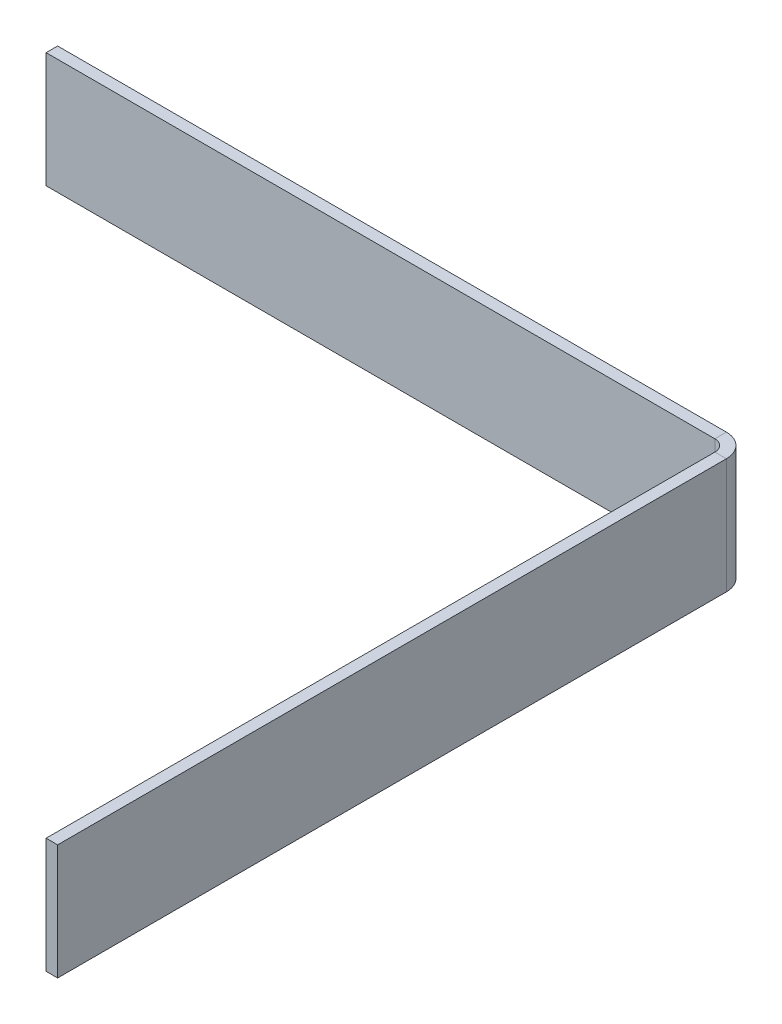
ISO-10303-21;
HEADER;
FILE_DESCRIPTION(('STEP AP214'),'2;1');
FILE_NAME('part.step','',(''),(''),'','','');
FILE_SCHEMA(('AUTOMOTIVE_DESIGN { 1 0 10303 214 1 1 1 1 }'));
ENDSEC;
DATA;
#1=APPLICATION_CONTEXT('core data for automotive mechanical design processes');
#2=APPLICATION_PROTOCOL_DEFINITION('international standard','automotive_design',2000,#1);
#3=PRODUCT_CONTEXT('',#1,'mechanical');
#4=PRODUCT('Part','Part','',(#3));
#5=PRODUCT_RELATED_PRODUCT_CATEGORY('part','',(#4));
#6=PRODUCT_DEFINITION_FORMATION('','',#4);
#7=PRODUCT_DEFINITION_CONTEXT('part definition',#1,'design');
#8=PRODUCT_DEFINITION('design','',#6,#7);
#9=PRODUCT_DEFINITION_SHAPE('','',#8);
#10=(LENGTH_UNIT() NAMED_UNIT(*) SI_UNIT(.MILLI.,.METRE.));
#11=(NAMED_UNIT(*) PLANE_ANGLE_UNIT() SI_UNIT($,.RADIAN.));
#12=(NAMED_UNIT(*) SI_UNIT($,.STERADIAN.) SOLID_ANGLE_UNIT());
#13=UNCERTAINTY_MEASURE_WITH_UNIT(LENGTH_MEASURE(1.E-05),#10,'distance_accuracy_value','');
#14=(GEOMETRIC_REPRESENTATION_CONTEXT(3) GLOBAL_UNCERTAINTY_ASSIGNED_CONTEXT((#13)) GLOBAL_UNIT_ASSIGNED_CONTEXT((#10,
#11,#12)) REPRESENTATION_CONTEXT('',''));
#15=CARTESIAN_POINT('',(0.,0.,0.));
#16=DIRECTION('',(0.,0.,1.));
#17=DIRECTION('',(1.,0.,0.));
#18=AXIS2_PLACEMENT_3D('',#15,#16,#17);
#19=CARTESIAN_POINT('',(0.,20.,2.));
#20=DIRECTION('',(0.,-1.,0.));
#21=DIRECTION('',(-1.,0.,0.));
#22=AXIS2_PLACEMENT_3D('',#19,#20,#21);
#23=PLANE('',#22);
#24=DIRECTION('',(-1.,0.,0.));
#25=VECTOR('',#24,1.);
#26=CARTESIAN_POINT('',(0.,20.,2.));
#27=LINE('',#26,#25);
#28=CARTESIAN_POINT('',(116.,20.,1.99999999999999));
#29=VERTEX_POINT('',#28);
#30=CARTESIAN_POINT('',(0.,20.,2.));
#31=VERTEX_POINT('',#30);
#32=EDGE_CURVE('E85',#29,#31,#27,.T.);
#33=ORIENTED_EDGE('',*,*,#32,.F.);
#34=DIRECTION('',(0.,0.,-1.));
#35=VECTOR('',#34,1.);
#36=CARTESIAN_POINT('',(116.,20.,1.99999999999999));
#37=LINE('',#36,#35);
#38=CARTESIAN_POINT('',(116.,20.,0.));
#39=VERTEX_POINT('',#38);
#40=EDGE_CURVE('E143',#29,#39,#37,.T.);
#41=ORIENTED_EDGE('',*,*,#40,.T.);
#42=DIRECTION('',(-1.,0.,0.));
#43=VECTOR('',#42,1.);
#44=CARTESIAN_POINT('',(0.,20.,0.));
#45=LINE('',#44,#43);
#46=CARTESIAN_POINT('',(0.,20.,0.));
#47=VERTEX_POINT('',#46);
#48=EDGE_CURVE('E186',#39,#47,#45,.T.);
#49=ORIENTED_EDGE('',*,*,#48,.T.);
#50=DIRECTION('',(0.,0.,1.));
#51=VECTOR('',#50,1.);
#52=CARTESIAN_POINT('',(0.,20.,2.));
#53=LINE('',#52,#51);
#54=EDGE_CURVE('E13',#47,#31,#53,.T.);
#55=ORIENTED_EDGE('',*,*,#54,.T.);
#56=EDGE_LOOP('',(#33,#41,#49,#55));
#57=FACE_BOUND('',#56,.T.);
#58=ADVANCED_FACE('F61',(#57),#23,.F.);
#59=CARTESIAN_POINT('',(0.,0.,2.));
#60=DIRECTION('',(0.,0.,-1.));
#61=DIRECTION('',(-1.,0.,0.));
#62=AXIS2_PLACEMENT_3D('',#59,#60,#61);
#63=PLANE('',#62);
#64=DIRECTION('',(0.,1.,0.));
#65=VECTOR('',#64,1.);
#66=CARTESIAN_POINT('',(116.,20.,1.99999999999999));
#67=LINE('',#66,#65);
#68=CARTESIAN_POINT('',(116.,0.,1.99999999999999));
#69=VERTEX_POINT('',#68);
#70=EDGE_CURVE('E144',#29,#69,#67,.F.);
#71=ORIENTED_EDGE('',*,*,#70,.F.);
#72=ORIENTED_EDGE('',*,*,#32,.T.);
#73=DIRECTION('',(0.,-1.,0.));
#74=VECTOR('',#73,1.);
#75=CARTESIAN_POINT('',(0.,0.,2.));
#76=LINE('',#75,#74);
#77=CARTESIAN_POINT('',(0.,0.,2.));
#78=VERTEX_POINT('',#77);
#79=EDGE_CURVE('E183',#31,#78,#76,.T.);
#80=ORIENTED_EDGE('',*,*,#79,.T.);
#81=DIRECTION('',(1.,0.,0.));
#82=VECTOR('',#81,1.);
#83=CARTESIAN_POINT('',(0.,0.,2.));
#84=LINE('',#83,#82);
#85=EDGE_CURVE('E185',#78,#69,#84,.T.);
#86=ORIENTED_EDGE('',*,*,#85,.T.);
#87=EDGE_LOOP('',(#71,#72,#80,#86));
#88=FACE_BOUND('',#87,.T.);
#89=ADVANCED_FACE('F205',(#88),#63,.F.);
#90=CARTESIAN_POINT('',(0.,0.,0.));
#91=DIRECTION('',(0.,0.,-1.));
#92=DIRECTION('',(-1.,0.,0.));
#93=AXIS2_PLACEMENT_3D('',#90,#91,#92);
#94=PLANE('',#93);
#95=ORIENTED_EDGE('',*,*,#48,.F.);
#96=DIRECTION('',(0.,1.,0.));
#97=VECTOR('',#96,1.);
#98=CARTESIAN_POINT('',(116.,20.,0.));
#99=LINE('',#98,#97);
#100=CARTESIAN_POINT('',(116.,0.,0.));
#101=VERTEX_POINT('',#100);
#102=EDGE_CURVE('E103',#39,#101,#99,.F.);
#103=ORIENTED_EDGE('',*,*,#102,.T.);
#104=DIRECTION('',(-1.,0.,0.));
#105=VECTOR('',#104,1.);
#106=CARTESIAN_POINT('',(0.,0.,0.));
#107=LINE('',#106,#105);
#108=CARTESIAN_POINT('',(0.,0.,0.));
#109=VERTEX_POINT('',#108);
#110=EDGE_CURVE('E192',#109,#101,#107,.F.);
#111=ORIENTED_EDGE('',*,*,#110,.F.);
#112=DIRECTION('',(0.,1.,0.));
#113=VECTOR('',#112,1.);
#114=CARTESIAN_POINT('',(0.,0.,0.));
#115=LINE('',#114,#113);
#116=EDGE_CURVE('E181',#47,#109,#115,.F.);
#117=ORIENTED_EDGE('',*,*,#116,.F.);
#118=EDGE_LOOP('',(#95,#103,#111,#117));
#119=FACE_BOUND('',#118,.T.);
#120=ADVANCED_FACE('F198',(#119),#94,.T.);
#121=CARTESIAN_POINT('',(0.,0.,2.));
#122=DIRECTION('',(1.,0.,0.));
#123=DIRECTION('',(0.,-1.,0.));
#124=AXIS2_PLACEMENT_3D('',#121,#122,#123);
#125=PLANE('',#124);
#126=ORIENTED_EDGE('',*,*,#54,.F.);
#127=ORIENTED_EDGE('',*,*,#116,.T.);
#128=DIRECTION('',(0.,0.,1.));
#129=VECTOR('',#128,1.);
#130=CARTESIAN_POINT('',(0.,0.,2.));
#131=LINE('',#130,#129);
#132=EDGE_CURVE('E65',#109,#78,#131,.T.);
#133=ORIENTED_EDGE('',*,*,#132,.T.);
#134=ORIENTED_EDGE('',*,*,#79,.F.);
#135=EDGE_LOOP('',(#126,#127,#133,#134));
#136=FACE_BOUND('',#135,.T.);
#137=ADVANCED_FACE('F201',(#136),#125,.F.);
#138=CARTESIAN_POINT('',(0.,0.,2.));
#139=DIRECTION('',(0.,1.,0.));
#140=DIRECTION('',(1.,0.,0.));
#141=AXIS2_PLACEMENT_3D('',#138,#139,#140);
#142=PLANE('',#141);
#143=DIRECTION('',(0.,0.,-1.));
#144=VECTOR('',#143,1.);
#145=CARTESIAN_POINT('',(116.,0.,1.99999999999999));
#146=LINE('',#145,#144);
#147=EDGE_CURVE('E179',#69,#101,#146,.T.);
#148=ORIENTED_EDGE('',*,*,#147,.F.);
#149=ORIENTED_EDGE('',*,*,#85,.F.);
#150=ORIENTED_EDGE('',*,*,#132,.F.);
#151=ORIENTED_EDGE('',*,*,#110,.T.);
#152=EDGE_LOOP('',(#148,#149,#150,#151));
#153=FACE_BOUND('',#152,.T.);
#154=ADVANCED_FACE('F63',(#153),#142,.F.);
#155=CARTESIAN_POINT('',(116.,0.,4.));
#156=DIRECTION('',(0.,-1.,0.));
#157=DIRECTION('',(0.,0.,-1.));
#158=AXIS2_PLACEMENT_3D('',#155,#156,#157);
#159=PLANE('',#158);
#160=DIRECTION('',(-1.,0.,0.));
#161=VECTOR('',#160,1.);
#162=CARTESIAN_POINT('',(120.,0.,3.99999999999998));
#163=LINE('',#162,#161);
#164=CARTESIAN_POINT('',(118.,0.,3.99999999999999));
#165=VERTEX_POINT('',#164);
#166=CARTESIAN_POINT('',(120.,0.,3.99999999999998));
#167=VERTEX_POINT('',#166);
#168=EDGE_CURVE('E134',#165,#167,#163,.F.);
#169=ORIENTED_EDGE('',*,*,#168,.F.);
#170=CARTESIAN_POINT('',(116.,0.,4.));
#171=DIRECTION('',(0.,1.,0.));
#172=DIRECTION('',(0.,0.,1.));
#173=AXIS2_PLACEMENT_3D('',#170,#171,#172);
#174=CIRCLE('',#173,2.);
#175=EDGE_CURVE('E128',#69,#165,#174,.F.);
#176=ORIENTED_EDGE('',*,*,#175,.F.);
#177=ORIENTED_EDGE('',*,*,#147,.T.);
#178=CARTESIAN_POINT('',(116.,0.,4.));
#179=DIRECTION('',(0.,1.,0.));
#180=DIRECTION('',(0.,0.,1.));
#181=AXIS2_PLACEMENT_3D('',#178,#179,#180);
#182=CIRCLE('',#181,4.);
#183=EDGE_CURVE('E76',#101,#167,#182,.F.);
#184=ORIENTED_EDGE('',*,*,#183,.T.);
#185=EDGE_LOOP('',(#169,#176,#177,#184));
#186=FACE_BOUND('',#185,.T.);
#187=ADVANCED_FACE('F218',(#186),#159,.T.);
#188=CARTESIAN_POINT('',(116.,20.,4.));
#189=DIRECTION('',(0.,-1.,0.));
#190=DIRECTION('',(0.,0.,-1.));
#191=AXIS2_PLACEMENT_3D('',#188,#189,#190);
#192=PLANE('',#191);
#193=CARTESIAN_POINT('',(116.,20.,4.));
#194=DIRECTION('',(0.,1.,0.));
#195=DIRECTION('',(0.,0.,1.));
#196=AXIS2_PLACEMENT_3D('',#193,#194,#195);
#197=CIRCLE('',#196,2.);
#198=CARTESIAN_POINT('',(118.,20.,3.99999999999999));
#199=VERTEX_POINT('',#198);
#200=EDGE_CURVE('E126',#199,#29,#197,.T.);
#201=ORIENTED_EDGE('',*,*,#200,.F.);
#202=DIRECTION('',(-1.,0.,0.));
#203=VECTOR('',#202,1.);
#204=CARTESIAN_POINT('',(118.,20.,3.99999999999999));
#205=LINE('',#204,#203);
#206=CARTESIAN_POINT('',(120.,20.,3.99999999999998));
#207=VERTEX_POINT('',#206);
#208=EDGE_CURVE('E133',#199,#207,#205,.F.);
#209=ORIENTED_EDGE('',*,*,#208,.T.);
#210=CARTESIAN_POINT('',(116.,20.,4.));
#211=DIRECTION('',(0.,1.,0.));
#212=DIRECTION('',(0.,0.,1.));
#213=AXIS2_PLACEMENT_3D('',#210,#211,#212);
#214=CIRCLE('',#213,4.);
#215=EDGE_CURVE('E174',#207,#39,#214,.T.);
#216=ORIENTED_EDGE('',*,*,#215,.T.);
#217=ORIENTED_EDGE('',*,*,#40,.F.);
#218=EDGE_LOOP('',(#201,#209,#216,#217));
#219=FACE_BOUND('',#218,.T.);
#220=ADVANCED_FACE('F139',(#219),#192,.F.);
#221=CARTESIAN_POINT('',(116.,20.,4.));
#222=DIRECTION('',(0.,1.,0.));
#223=DIRECTION('',(1.,0.,0.));
#224=AXIS2_PLACEMENT_3D('',#221,#222,#223);
#225=CYLINDRICAL_SURFACE('',#224,4.);
#226=ORIENTED_EDGE('',*,*,#102,.F.);
#227=ORIENTED_EDGE('',*,*,#215,.F.);
#228=DIRECTION('',(0.,1.,0.));
#229=VECTOR('',#228,1.);
#230=CARTESIAN_POINT('',(120.,0.,3.99999999999998));
#231=LINE('',#230,#229);
#232=EDGE_CURVE('E157',#207,#167,#231,.F.);
#233=ORIENTED_EDGE('',*,*,#232,.T.);
#234=ORIENTED_EDGE('',*,*,#183,.F.);
#235=EDGE_LOOP('',(#226,#227,#233,#234));
#236=FACE_BOUND('',#235,.T.);
#237=ADVANCED_FACE('F217',(#236),#225,.T.);
#238=CARTESIAN_POINT('',(116.,20.,4.));
#239=DIRECTION('',(0.,1.,0.));
#240=DIRECTION('',(1.,0.,0.));
#241=AXIS2_PLACEMENT_3D('',#238,#239,#240);
#242=CYLINDRICAL_SURFACE('',#241,2.);
#243=ORIENTED_EDGE('',*,*,#70,.T.);
#244=ORIENTED_EDGE('',*,*,#175,.T.);
#245=DIRECTION('',(0.,1.,0.));
#246=VECTOR('',#245,1.);
#247=CARTESIAN_POINT('',(118.,0.,3.99999999999999));
#248=LINE('',#247,#246);
#249=EDGE_CURVE('E123',#165,#199,#248,.T.);
#250=ORIENTED_EDGE('',*,*,#249,.T.);
#251=ORIENTED_EDGE('',*,*,#200,.T.);
#252=EDGE_LOOP('',(#243,#244,#250,#251));
#253=FACE_BOUND('',#252,.T.);
#254=ADVANCED_FACE('F125',(#253),#242,.F.);
#255=CARTESIAN_POINT('',(120.,0.,1.99999999999999));
#256=DIRECTION('',(0.,1.,0.));
#257=DIRECTION('',(0.,0.,1.));
#258=AXIS2_PLACEMENT_3D('',#255,#256,#257);
#259=PLANE('',#258);
#260=ORIENTED_EDGE('',*,*,#168,.T.);
#261=DIRECTION('',(0.,0.,-1.));
#262=VECTOR('',#261,1.);
#263=CARTESIAN_POINT('',(120.,0.,-4.3037309918728E-13));
#264=LINE('',#263,#262);
#265=CARTESIAN_POINT('',(120.,0.,120.));
#266=VERTEX_POINT('',#265);
#267=EDGE_CURVE('E165',#266,#167,#264,.T.);
#268=ORIENTED_EDGE('',*,*,#267,.F.);
#269=DIRECTION('',(-1.,0.,0.));
#270=VECTOR('',#269,1.);
#271=CARTESIAN_POINT('',(120.,0.,120.));
#272=LINE('',#271,#270);
#273=CARTESIAN_POINT('',(118.,0.,120.));
#274=VERTEX_POINT('',#273);
#275=EDGE_CURVE('E250',#266,#274,#272,.T.);
#276=ORIENTED_EDGE('',*,*,#275,.T.);
#277=DIRECTION('',(0.,0.,1.));
#278=VECTOR('',#277,1.);
#279=CARTESIAN_POINT('',(118.,0.,2.));
#280=LINE('',#279,#278);
#281=EDGE_CURVE('E163',#274,#165,#280,.F.);
#282=ORIENTED_EDGE('',*,*,#281,.T.);
#283=EDGE_LOOP('',(#260,#268,#276,#282));
#284=FACE_BOUND('',#283,.T.);
#285=ADVANCED_FACE('F224',(#284),#259,.F.);
#286=CARTESIAN_POINT('',(120.,20.,120.));
#287=DIRECTION('',(0.,-1.,0.));
#288=DIRECTION('',(0.,0.,-1.));
#289=AXIS2_PLACEMENT_3D('',#286,#287,#288);
#290=PLANE('',#289);
#291=ORIENTED_EDGE('',*,*,#208,.F.);
#292=DIRECTION('',(0.,0.,-1.));
#293=VECTOR('',#292,1.);
#294=CARTESIAN_POINT('',(118.,20.,120.));
#295=LINE('',#294,#293);
#296=CARTESIAN_POINT('',(118.,20.,120.));
#297=VERTEX_POINT('',#296);
#298=EDGE_CURVE('E153',#199,#297,#295,.F.);
#299=ORIENTED_EDGE('',*,*,#298,.T.);
#300=DIRECTION('',(-1.,0.,0.));
#301=VECTOR('',#300,1.);
#302=CARTESIAN_POINT('',(120.,20.,120.));
#303=LINE('',#302,#301);
#304=CARTESIAN_POINT('',(120.,20.,120.));
#305=VERTEX_POINT('',#304);
#306=EDGE_CURVE('E145',#305,#297,#303,.T.);
#307=ORIENTED_EDGE('',*,*,#306,.F.);
#308=DIRECTION('',(0.,0.,1.));
#309=VECTOR('',#308,1.);
#310=CARTESIAN_POINT('',(120.,20.,-4.3037309918728E-13));
#311=LINE('',#310,#309);
#312=EDGE_CURVE('E156',#207,#305,#311,.T.);
#313=ORIENTED_EDGE('',*,*,#312,.F.);
#314=EDGE_LOOP('',(#291,#299,#307,#313));
#315=FACE_BOUND('',#314,.T.);
#316=ADVANCED_FACE('F150',(#315),#290,.F.);
#317=CARTESIAN_POINT('',(120.,0.,-4.3037309918728E-13));
#318=DIRECTION('',(-1.,0.,0.));
#319=DIRECTION('',(0.,0.,1.));
#320=AXIS2_PLACEMENT_3D('',#317,#318,#319);
#321=PLANE('',#320);
#322=ORIENTED_EDGE('',*,*,#232,.F.);
#323=ORIENTED_EDGE('',*,*,#312,.T.);
#324=DIRECTION('',(0.,-1.,0.));
#325=VECTOR('',#324,1.);
#326=CARTESIAN_POINT('',(120.,0.,120.));
#327=LINE('',#326,#325);
#328=EDGE_CURVE('E256',#305,#266,#327,.T.);
#329=ORIENTED_EDGE('',*,*,#328,.T.);
#330=ORIENTED_EDGE('',*,*,#267,.T.);
#331=EDGE_LOOP('',(#322,#323,#329,#330));
#332=FACE_BOUND('',#331,.T.);
#333=ADVANCED_FACE('F232',(#332),#321,.F.);
#334=CARTESIAN_POINT('',(118.,0.,-4.23390136509594E-13));
#335=DIRECTION('',(-1.,0.,0.));
#336=DIRECTION('',(0.,0.,1.));
#337=AXIS2_PLACEMENT_3D('',#334,#335,#336);
#338=PLANE('',#337);
#339=ORIENTED_EDGE('',*,*,#298,.F.);
#340=ORIENTED_EDGE('',*,*,#249,.F.);
#341=ORIENTED_EDGE('',*,*,#281,.F.);
#342=DIRECTION('',(0.,1.,0.));
#343=VECTOR('',#342,1.);
#344=CARTESIAN_POINT('',(118.,0.,120.));
#345=LINE('',#344,#343);
#346=EDGE_CURVE('E162',#297,#274,#345,.F.);
#347=ORIENTED_EDGE('',*,*,#346,.F.);
#348=EDGE_LOOP('',(#339,#340,#341,#347));
#349=FACE_BOUND('',#348,.T.);
#350=ADVANCED_FACE('F160',(#349),#338,.T.);
#351=CARTESIAN_POINT('',(120.,0.,120.));
#352=DIRECTION('',(0.,0.,-1.));
#353=DIRECTION('',(-1.,0.,0.));
#354=AXIS2_PLACEMENT_3D('',#351,#352,#353);
#355=PLANE('',#354);
#356=ORIENTED_EDGE('',*,*,#346,.T.);
#357=ORIENTED_EDGE('',*,*,#275,.F.);
#358=ORIENTED_EDGE('',*,*,#328,.F.);
#359=ORIENTED_EDGE('',*,*,#306,.T.);
#360=EDGE_LOOP('',(#356,#357,#358,#359));
#361=FACE_BOUND('',#360,.T.);
#362=ADVANCED_FACE('F233',(#361),#355,.F.);
#363=CLOSED_SHELL('',(#58,#89,#120,#137,#154,#187,#220,#237,#254,#285,#316,#333,#350,#362));
#364=MANIFOLD_SOLID_BREP('B2',#363);
#365=ADVANCED_BREP_SHAPE_REPRESENTATION('',(#18,#364),#14);
#366=SHAPE_DEFINITION_REPRESENTATION(#9,#365);
ENDSEC;
END-ISO-10303-21;
